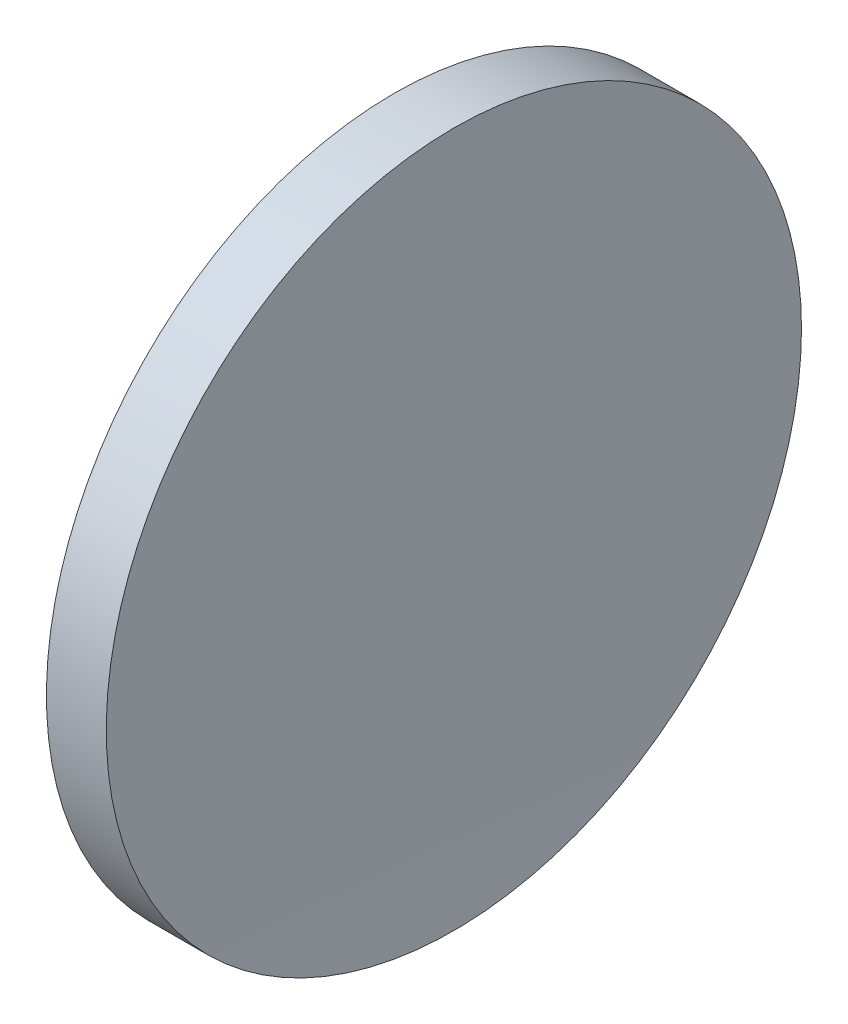
ISO-10303-21;
HEADER;
FILE_DESCRIPTION(('STEP AP214'),'2;1');
FILE_NAME('part.step','',(''),(''),'','','');
FILE_SCHEMA(('AUTOMOTIVE_DESIGN { 1 0 10303 214 1 1 1 1 }'));
ENDSEC;
DATA;
#1=APPLICATION_CONTEXT('core data for automotive mechanical design processes');
#2=APPLICATION_PROTOCOL_DEFINITION('international standard','automotive_design',2000,#1);
#3=PRODUCT_CONTEXT('',#1,'mechanical');
#4=PRODUCT('Part','Part','',(#3));
#5=PRODUCT_RELATED_PRODUCT_CATEGORY('part','',(#4));
#6=PRODUCT_DEFINITION_FORMATION('','',#4);
#7=PRODUCT_DEFINITION_CONTEXT('part definition',#1,'design');
#8=PRODUCT_DEFINITION('design','',#6,#7);
#9=PRODUCT_DEFINITION_SHAPE('','',#8);
#10=(LENGTH_UNIT() NAMED_UNIT(*) SI_UNIT(.MILLI.,.METRE.));
#11=(NAMED_UNIT(*) PLANE_ANGLE_UNIT() SI_UNIT($,.RADIAN.));
#12=(NAMED_UNIT(*) SI_UNIT($,.STERADIAN.) SOLID_ANGLE_UNIT());
#13=UNCERTAINTY_MEASURE_WITH_UNIT(LENGTH_MEASURE(1.E-05),#10,'distance_accuracy_value','');
#14=(GEOMETRIC_REPRESENTATION_CONTEXT(3) GLOBAL_UNCERTAINTY_ASSIGNED_CONTEXT((#13)) GLOBAL_UNIT_ASSIGNED_CONTEXT((#10,
#11,#12)) REPRESENTATION_CONTEXT('',''));
#15=CARTESIAN_POINT('',(0.,0.,0.));
#16=DIRECTION('',(0.,0.,1.));
#17=DIRECTION('',(1.,0.,0.));
#18=AXIS2_PLACEMENT_3D('',#15,#16,#17);
#19=CARTESIAN_POINT('',(1241.74552015577,34.5168962409161,22.1552279145953));
#20=DIRECTION('',(1.,0.,0.));
#21=DIRECTION('',(0.,1.,0.));
#22=AXIS2_PLACEMENT_3D('',#19,#20,#21);
#23=SPHERICAL_SURFACE('',#22,1326.3);
#24=CARTESIAN_POINT('',(-84.3112395645704,34.5168962409161,22.1552279145953));
#25=DIRECTION('',(1.,0.,0.));
#26=DIRECTION('',(0.,0.,-1.));
#27=AXIS2_PLACEMENT_3D('',#24,#25,#26);
#28=CIRCLE('',#27,25.4);
#29=CARTESIAN_POINT('',(-84.3112395645704,34.5168962409161,-3.24477208540466));
#30=VERTEX_POINT('',#29);
#31=EDGE_CURVE('E8',#30,#30,#28,.T.);
#32=ORIENTED_EDGE('',*,*,#31,.T.);
#33=EDGE_LOOP('',(#32));
#34=FACE_BOUND('',#33,.T.);
#35=ADVANCED_FACE('F13',(#34),#23,.F.);
#36=CARTESIAN_POINT('',(-84.5544798442333,34.5168962409161,22.1552279145953));
#37=DIRECTION('',(1.,0.,0.));
#38=DIRECTION('',(0.,0.,-1.));
#39=AXIS2_PLACEMENT_3D('',#36,#37,#38);
#40=CYLINDRICAL_SURFACE('',#39,25.4);
#41=CARTESIAN_POINT('',(-88.6853795545218,34.5168962409161,22.1552279145953));
#42=DIRECTION('',(1.,0.,0.));
#43=DIRECTION('',(0.,0.,-1.));
#44=AXIS2_PLACEMENT_3D('',#41,#42,#43);
#45=CIRCLE('',#44,25.4);
#46=CARTESIAN_POINT('',(-88.6853795545218,34.5168962409161,-3.24477208540468));
#47=VERTEX_POINT('',#46);
#48=EDGE_CURVE('E19',#47,#47,#45,.T.);
#49=ORIENTED_EDGE('',*,*,#48,.T.);
#50=EDGE_LOOP('',(#49));
#51=FACE_BOUND('',#50,.T.);
#52=ORIENTED_EDGE('',*,*,#31,.F.);
#53=EDGE_LOOP('',(#52));
#54=FACE_BOUND('',#53,.T.);
#55=ADVANCED_FACE('F25',(#51,#54),#40,.T.);
#56=CARTESIAN_POINT('',(282.045520155767,34.5168962409161,22.1552279145953));
#57=DIRECTION('',(1.,0.,0.));
#58=DIRECTION('',(0.,1.,0.));
#59=AXIS2_PLACEMENT_3D('',#56,#57,#58);
#60=SPHERICAL_SURFACE('',#59,371.6);
#61=ORIENTED_EDGE('',*,*,#48,.F.);
#62=EDGE_LOOP('',(#61));
#63=FACE_BOUND('',#62,.T.);
#64=ADVANCED_FACE('F28',(#63),#60,.T.);
#65=CLOSED_SHELL('',(#35,#55,#64));
#66=MANIFOLD_SOLID_BREP('B1',#65);
#67=ADVANCED_BREP_SHAPE_REPRESENTATION('',(#18,#66),#14);
#68=SHAPE_DEFINITION_REPRESENTATION(#9,#67);
ENDSEC;
END-ISO-10303-21;
